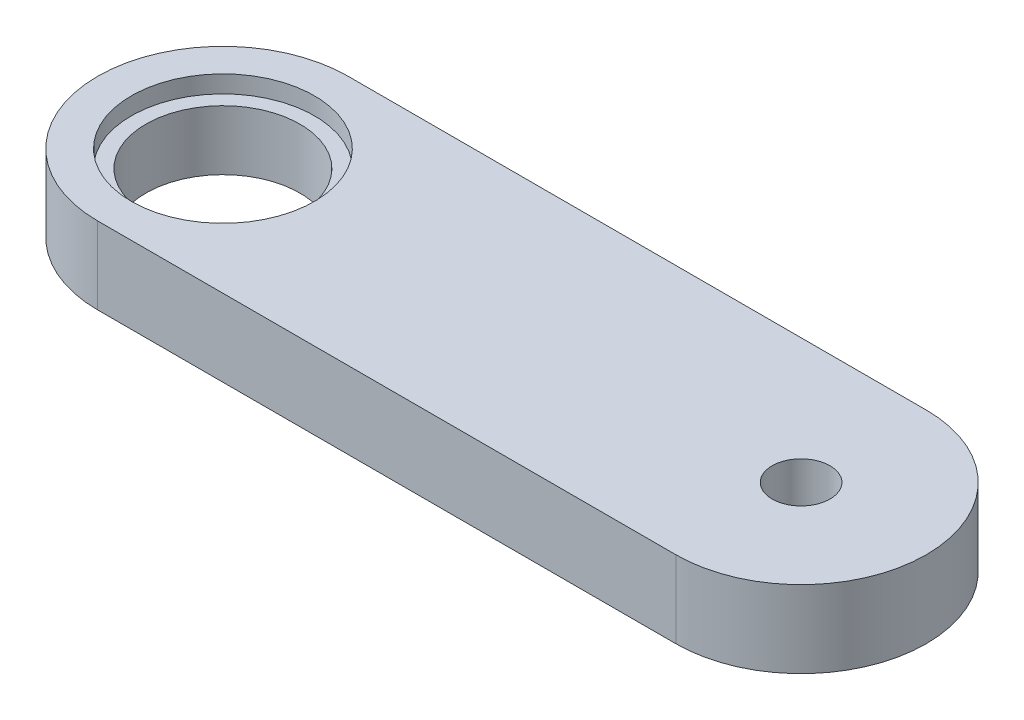
ISO-10303-21;
HEADER;
FILE_DESCRIPTION(('STEP AP214'),'2;1');
FILE_NAME('part.step','',(''),(''),'','','');
FILE_SCHEMA(('AUTOMOTIVE_DESIGN { 1 0 10303 214 1 1 1 1 }'));
ENDSEC;
DATA;
#1=APPLICATION_CONTEXT('core data for automotive mechanical design processes');
#2=APPLICATION_PROTOCOL_DEFINITION('international standard','automotive_design',2000,#1);
#3=PRODUCT_CONTEXT('',#1,'mechanical');
#4=PRODUCT('Part','Part','',(#3));
#5=PRODUCT_RELATED_PRODUCT_CATEGORY('part','',(#4));
#6=PRODUCT_DEFINITION_FORMATION('','',#4);
#7=PRODUCT_DEFINITION_CONTEXT('part definition',#1,'design');
#8=PRODUCT_DEFINITION('design','',#6,#7);
#9=PRODUCT_DEFINITION_SHAPE('','',#8);
#10=(LENGTH_UNIT() NAMED_UNIT(*) SI_UNIT(.MILLI.,.METRE.));
#11=(NAMED_UNIT(*) PLANE_ANGLE_UNIT() SI_UNIT($,.RADIAN.));
#12=(NAMED_UNIT(*) SI_UNIT($,.STERADIAN.) SOLID_ANGLE_UNIT());
#13=UNCERTAINTY_MEASURE_WITH_UNIT(LENGTH_MEASURE(1.E-05),#10,'distance_accuracy_value','');
#14=(GEOMETRIC_REPRESENTATION_CONTEXT(3) GLOBAL_UNCERTAINTY_ASSIGNED_CONTEXT((#13)) GLOBAL_UNIT_ASSIGNED_CONTEXT((#10,
#11,#12)) REPRESENTATION_CONTEXT('',''));
#15=CARTESIAN_POINT('',(0.,0.,0.));
#16=DIRECTION('',(0.,0.,1.));
#17=DIRECTION('',(1.,0.,0.));
#18=AXIS2_PLACEMENT_3D('',#15,#16,#17);
#19=CARTESIAN_POINT('',(0.,4.,0.));
#20=DIRECTION('',(0.,-1.,0.));
#21=DIRECTION('',(0.,0.,-1.));
#22=AXIS2_PLACEMENT_3D('',#19,#20,#21);
#23=CYLINDRICAL_SURFACE('',#22,6.5);
#24=CARTESIAN_POINT('',(0.,0.,0.));
#25=DIRECTION('',(0.,1.,0.));
#26=DIRECTION('',(0.,0.,1.));
#27=AXIS2_PLACEMENT_3D('',#24,#25,#26);
#28=CIRCLE('',#27,6.5);
#29=CARTESIAN_POINT('',(0.,0.,-6.5));
#30=VERTEX_POINT('',#29);
#31=CARTESIAN_POINT('',(0.,0.,6.5));
#32=VERTEX_POINT('',#31);
#33=EDGE_CURVE('E110',#30,#32,#28,.T.);
#34=ORIENTED_EDGE('',*,*,#33,.T.);
#35=DIRECTION('',(0.,-1.,0.));
#36=VECTOR('',#35,1.);
#37=CARTESIAN_POINT('',(0.,4.,6.5));
#38=LINE('',#37,#36);
#39=CARTESIAN_POINT('',(0.,4.,6.5));
#40=VERTEX_POINT('',#39);
#41=EDGE_CURVE('E11',#40,#32,#38,.T.);
#42=ORIENTED_EDGE('',*,*,#41,.F.);
#43=CARTESIAN_POINT('',(0.,4.,0.));
#44=DIRECTION('',(0.,1.,0.));
#45=DIRECTION('',(0.,0.,1.));
#46=AXIS2_PLACEMENT_3D('',#43,#44,#45);
#47=CIRCLE('',#46,6.5);
#48=CARTESIAN_POINT('',(0.,4.,-6.5));
#49=VERTEX_POINT('',#48);
#50=EDGE_CURVE('E97',#49,#40,#47,.T.);
#51=ORIENTED_EDGE('',*,*,#50,.F.);
#52=DIRECTION('',(0.,-1.,0.));
#53=VECTOR('',#52,1.);
#54=CARTESIAN_POINT('',(0.,4.,-6.5));
#55=LINE('',#54,#53);
#56=EDGE_CURVE('E106',#49,#30,#55,.T.);
#57=ORIENTED_EDGE('',*,*,#56,.T.);
#58=EDGE_LOOP('',(#34,#42,#51,#57));
#59=FACE_BOUND('',#58,.T.);
#60=ADVANCED_FACE('F45',(#59),#23,.T.);
#61=CARTESIAN_POINT('',(0.,4.,6.5));
#62=DIRECTION('',(0.,0.,-1.));
#63=DIRECTION('',(-1.,0.,0.));
#64=AXIS2_PLACEMENT_3D('',#61,#62,#63);
#65=PLANE('',#64);
#66=DIRECTION('',(1.,0.,0.));
#67=VECTOR('',#66,1.);
#68=CARTESIAN_POINT('',(0.,0.,6.5));
#69=LINE('',#68,#67);
#70=CARTESIAN_POINT('',(30.,0.,6.5));
#71=VERTEX_POINT('',#70);
#72=EDGE_CURVE('E101',#32,#71,#69,.T.);
#73=ORIENTED_EDGE('',*,*,#72,.T.);
#74=DIRECTION('',(0.,-1.,0.));
#75=VECTOR('',#74,1.);
#76=CARTESIAN_POINT('',(30.,4.,6.5));
#77=LINE('',#76,#75);
#78=CARTESIAN_POINT('',(30.,4.,6.5));
#79=VERTEX_POINT('',#78);
#80=EDGE_CURVE('E54',#79,#71,#77,.T.);
#81=ORIENTED_EDGE('',*,*,#80,.F.);
#82=DIRECTION('',(1.,0.,0.));
#83=VECTOR('',#82,1.);
#84=CARTESIAN_POINT('',(0.,4.,6.5));
#85=LINE('',#84,#83);
#86=EDGE_CURVE('E92',#40,#79,#85,.T.);
#87=ORIENTED_EDGE('',*,*,#86,.F.);
#88=ORIENTED_EDGE('',*,*,#41,.T.);
#89=EDGE_LOOP('',(#73,#81,#87,#88));
#90=FACE_BOUND('',#89,.T.);
#91=ADVANCED_FACE('F100',(#90),#65,.F.);
#92=CARTESIAN_POINT('',(30.,4.,0.));
#93=DIRECTION('',(0.,-1.,0.));
#94=DIRECTION('',(0.,0.,-1.));
#95=AXIS2_PLACEMENT_3D('',#92,#93,#94);
#96=CYLINDRICAL_SURFACE('',#95,6.5);
#97=CARTESIAN_POINT('',(30.,0.,0.));
#98=DIRECTION('',(0.,1.,0.));
#99=DIRECTION('',(0.,0.,1.));
#100=AXIS2_PLACEMENT_3D('',#97,#98,#99);
#101=CIRCLE('',#100,6.5);
#102=CARTESIAN_POINT('',(30.,0.,-6.5));
#103=VERTEX_POINT('',#102);
#104=EDGE_CURVE('E79',#71,#103,#101,.T.);
#105=ORIENTED_EDGE('',*,*,#104,.T.);
#106=DIRECTION('',(0.,-1.,0.));
#107=VECTOR('',#106,1.);
#108=CARTESIAN_POINT('',(30.,4.,-6.5));
#109=LINE('',#108,#107);
#110=CARTESIAN_POINT('',(30.,4.,-6.5));
#111=VERTEX_POINT('',#110);
#112=EDGE_CURVE('E102',#111,#103,#109,.T.);
#113=ORIENTED_EDGE('',*,*,#112,.F.);
#114=CARTESIAN_POINT('',(30.,4.,0.));
#115=DIRECTION('',(0.,1.,0.));
#116=DIRECTION('',(0.,0.,1.));
#117=AXIS2_PLACEMENT_3D('',#114,#115,#116);
#118=CIRCLE('',#117,6.5);
#119=EDGE_CURVE('E95',#79,#111,#118,.T.);
#120=ORIENTED_EDGE('',*,*,#119,.F.);
#121=ORIENTED_EDGE('',*,*,#80,.T.);
#122=EDGE_LOOP('',(#105,#113,#120,#121));
#123=FACE_BOUND('',#122,.T.);
#124=ADVANCED_FACE('F104',(#123),#96,.T.);
#125=CARTESIAN_POINT('',(0.,4.,-6.5));
#126=DIRECTION('',(0.,0.,1.));
#127=DIRECTION('',(1.,0.,0.));
#128=AXIS2_PLACEMENT_3D('',#125,#126,#127);
#129=PLANE('',#128);
#130=DIRECTION('',(-1.,0.,0.));
#131=VECTOR('',#130,1.);
#132=CARTESIAN_POINT('',(0.,0.,-6.5));
#133=LINE('',#132,#131);
#134=EDGE_CURVE('E85',#103,#30,#133,.T.);
#135=ORIENTED_EDGE('',*,*,#134,.T.);
#136=ORIENTED_EDGE('',*,*,#56,.F.);
#137=DIRECTION('',(-1.,0.,0.));
#138=VECTOR('',#137,1.);
#139=CARTESIAN_POINT('',(0.,4.,-6.5));
#140=LINE('',#139,#138);
#141=EDGE_CURVE('E62',#111,#49,#140,.T.);
#142=ORIENTED_EDGE('',*,*,#141,.F.);
#143=ORIENTED_EDGE('',*,*,#112,.T.);
#144=EDGE_LOOP('',(#135,#136,#142,#143));
#145=FACE_BOUND('',#144,.T.);
#146=ADVANCED_FACE('F117',(#145),#129,.F.);
#147=CARTESIAN_POINT('',(0.,4.,0.));
#148=DIRECTION('',(0.,1.,0.));
#149=DIRECTION('',(0.,0.,1.));
#150=AXIS2_PLACEMENT_3D('',#147,#148,#149);
#151=PLANE('',#150);
#152=CARTESIAN_POINT('',(30.,4.,0.));
#153=DIRECTION('',(0.,1.,0.));
#154=DIRECTION('',(0.,0.,1.));
#155=AXIS2_PLACEMENT_3D('',#152,#153,#154);
#156=CIRCLE('',#155,1.5);
#157=CARTESIAN_POINT('',(30.,4.,1.5));
#158=VERTEX_POINT('',#157);
#159=EDGE_CURVE('E132',#158,#158,#156,.T.);
#160=ORIENTED_EDGE('',*,*,#159,.F.);
#161=EDGE_LOOP('',(#160));
#162=FACE_BOUND('',#161,.T.);
#163=CARTESIAN_POINT('',(0.,4.,0.));
#164=DIRECTION('',(0.,1.,0.));
#165=DIRECTION('',(0.,0.,1.));
#166=AXIS2_PLACEMENT_3D('',#163,#164,#165);
#167=CIRCLE('',#166,4.75);
#168=CARTESIAN_POINT('',(0.,4.,4.75));
#169=VERTEX_POINT('',#168);
#170=EDGE_CURVE('E129',#169,#169,#167,.T.);
#171=ORIENTED_EDGE('',*,*,#170,.F.);
#172=EDGE_LOOP('',(#171));
#173=FACE_BOUND('',#172,.T.);
#174=ORIENTED_EDGE('',*,*,#50,.T.);
#175=ORIENTED_EDGE('',*,*,#86,.T.);
#176=ORIENTED_EDGE('',*,*,#119,.T.);
#177=ORIENTED_EDGE('',*,*,#141,.T.);
#178=EDGE_LOOP('',(#174,#175,#176,#177));
#179=FACE_BOUND('',#178,.T.);
#180=ADVANCED_FACE('F93',(#162,#173,#179),#151,.T.);
#181=CARTESIAN_POINT('',(0.,0.,0.));
#182=DIRECTION('',(0.,1.,0.));
#183=DIRECTION('',(0.,0.,1.));
#184=AXIS2_PLACEMENT_3D('',#181,#182,#183);
#185=PLANE('',#184);
#186=CARTESIAN_POINT('',(30.,0.,0.));
#187=DIRECTION('',(0.,1.,0.));
#188=DIRECTION('',(0.,0.,1.));
#189=AXIS2_PLACEMENT_3D('',#186,#187,#188);
#190=CIRCLE('',#189,1.5);
#191=CARTESIAN_POINT('',(30.,0.,1.5));
#192=VERTEX_POINT('',#191);
#193=EDGE_CURVE('E135',#192,#192,#190,.T.);
#194=ORIENTED_EDGE('',*,*,#193,.T.);
#195=EDGE_LOOP('',(#194));
#196=FACE_BOUND('',#195,.T.);
#197=CARTESIAN_POINT('',(0.,0.,0.));
#198=DIRECTION('',(0.,1.,0.));
#199=DIRECTION('',(0.,0.,1.));
#200=AXIS2_PLACEMENT_3D('',#197,#198,#199);
#201=CIRCLE('',#200,4.);
#202=CARTESIAN_POINT('',(0.,0.,4.));
#203=VERTEX_POINT('',#202);
#204=EDGE_CURVE('E48',#203,#203,#201,.T.);
#205=ORIENTED_EDGE('',*,*,#204,.T.);
#206=EDGE_LOOP('',(#205));
#207=FACE_BOUND('',#206,.T.);
#208=ORIENTED_EDGE('',*,*,#33,.F.);
#209=ORIENTED_EDGE('',*,*,#134,.F.);
#210=ORIENTED_EDGE('',*,*,#104,.F.);
#211=ORIENTED_EDGE('',*,*,#72,.F.);
#212=EDGE_LOOP('',(#208,#209,#210,#211));
#213=FACE_BOUND('',#212,.T.);
#214=ADVANCED_FACE('F120',(#196,#207,#213),#185,.F.);
#215=CARTESIAN_POINT('',(0.,4.,0.));
#216=DIRECTION('',(0.,1.,0.));
#217=DIRECTION('',(0.,0.,1.));
#218=AXIS2_PLACEMENT_3D('',#215,#216,#217);
#219=CYLINDRICAL_SURFACE('',#218,4.);
#220=CARTESIAN_POINT('',(0.,3.1,0.));
#221=DIRECTION('',(0.,1.,0.));
#222=DIRECTION('',(0.,0.,1.));
#223=AXIS2_PLACEMENT_3D('',#220,#221,#222);
#224=CIRCLE('',#223,4.);
#225=CARTESIAN_POINT('',(0.,3.1,4.));
#226=VERTEX_POINT('',#225);
#227=EDGE_CURVE('E123',#226,#226,#224,.T.);
#228=ORIENTED_EDGE('',*,*,#227,.T.);
#229=EDGE_LOOP('',(#228));
#230=FACE_BOUND('',#229,.T.);
#231=ORIENTED_EDGE('',*,*,#204,.F.);
#232=EDGE_LOOP('',(#231));
#233=FACE_BOUND('',#232,.T.);
#234=ADVANCED_FACE('F165',(#230,#233),#219,.F.);
#235=CARTESIAN_POINT('',(4.,3.1,0.));
#236=DIRECTION('',(0.,-1.,0.));
#237=DIRECTION('',(0.,0.,-1.));
#238=AXIS2_PLACEMENT_3D('',#235,#236,#237);
#239=PLANE('',#238);
#240=ORIENTED_EDGE('',*,*,#227,.F.);
#241=EDGE_LOOP('',(#240));
#242=FACE_BOUND('',#241,.T.);
#243=CARTESIAN_POINT('',(0.,3.1,0.));
#244=DIRECTION('',(0.,1.,0.));
#245=DIRECTION('',(0.,0.,1.));
#246=AXIS2_PLACEMENT_3D('',#243,#244,#245);
#247=CIRCLE('',#246,4.75);
#248=CARTESIAN_POINT('',(0.,3.1,4.75));
#249=VERTEX_POINT('',#248);
#250=EDGE_CURVE('E126',#249,#249,#247,.T.);
#251=ORIENTED_EDGE('',*,*,#250,.T.);
#252=EDGE_LOOP('',(#251));
#253=FACE_BOUND('',#252,.T.);
#254=ADVANCED_FACE('F149',(#242,#253),#239,.F.);
#255=CARTESIAN_POINT('',(0.,4.,0.));
#256=DIRECTION('',(0.,1.,0.));
#257=DIRECTION('',(0.,0.,1.));
#258=AXIS2_PLACEMENT_3D('',#255,#256,#257);
#259=CYLINDRICAL_SURFACE('',#258,4.75);
#260=ORIENTED_EDGE('',*,*,#250,.F.);
#261=EDGE_LOOP('',(#260));
#262=FACE_BOUND('',#261,.T.);
#263=ORIENTED_EDGE('',*,*,#170,.T.);
#264=EDGE_LOOP('',(#263));
#265=FACE_BOUND('',#264,.T.);
#266=ADVANCED_FACE('F143',(#262,#265),#259,.F.);
#267=CARTESIAN_POINT('',(30.,0.,0.));
#268=DIRECTION('',(0.,1.,0.));
#269=DIRECTION('',(0.,0.,1.));
#270=AXIS2_PLACEMENT_3D('',#267,#268,#269);
#271=CYLINDRICAL_SURFACE('',#270,1.5);
#272=ORIENTED_EDGE('',*,*,#159,.T.);
#273=EDGE_LOOP('',(#272));
#274=FACE_BOUND('',#273,.T.);
#275=ORIENTED_EDGE('',*,*,#193,.F.);
#276=EDGE_LOOP('',(#275));
#277=FACE_BOUND('',#276,.T.);
#278=ADVANCED_FACE('F141',(#274,#277),#271,.F.);
#279=CLOSED_SHELL('',(#60,#91,#124,#146,#180,#214,#234,#254,#266,#278));
#280=MANIFOLD_SOLID_BREP('B2',#279);
#281=ADVANCED_BREP_SHAPE_REPRESENTATION('',(#18,#280),#14);
#282=SHAPE_DEFINITION_REPRESENTATION(#9,#281);
ENDSEC;
END-ISO-10303-21;
